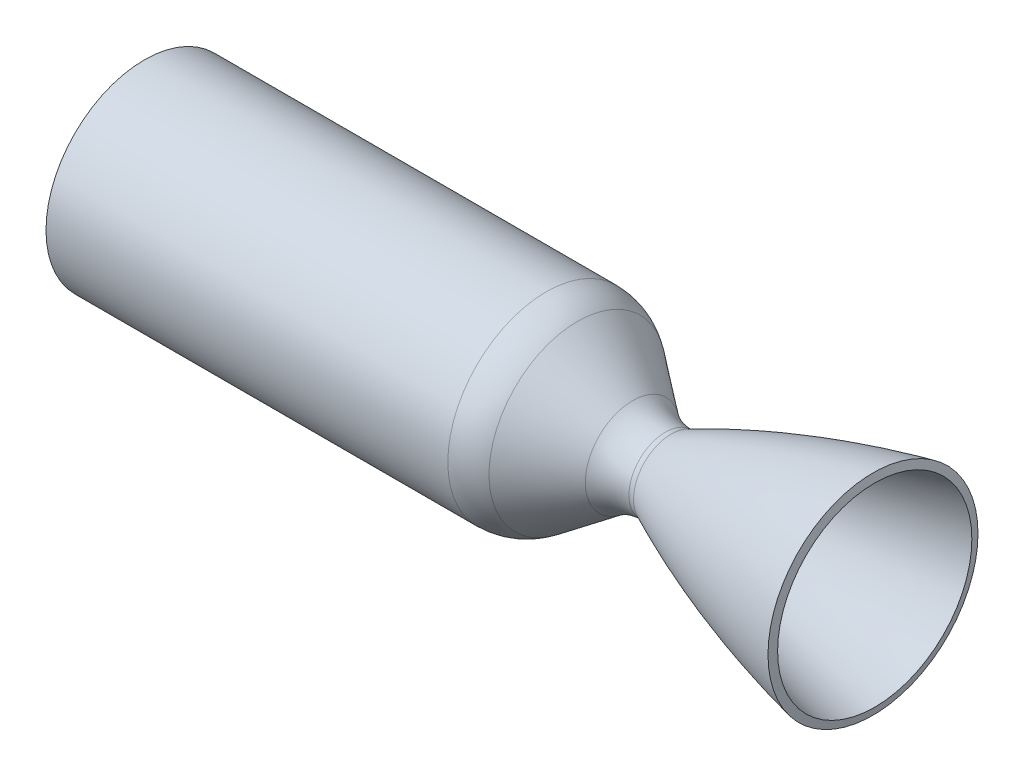
ISO-10303-21;
HEADER;
FILE_DESCRIPTION(('STEP AP214'),'2;1');
FILE_NAME('part.step','',(''),(''),'','','');
FILE_SCHEMA(('AUTOMOTIVE_DESIGN { 1 0 10303 214 1 1 1 1 }'));
ENDSEC;
DATA;
#1=APPLICATION_CONTEXT('core data for automotive mechanical design processes');
#2=APPLICATION_PROTOCOL_DEFINITION('international standard','automotive_design',2000,#1);
#3=PRODUCT_CONTEXT('',#1,'mechanical');
#4=PRODUCT('Part','Part','',(#3));
#5=PRODUCT_RELATED_PRODUCT_CATEGORY('part','',(#4));
#6=PRODUCT_DEFINITION_FORMATION('','',#4);
#7=PRODUCT_DEFINITION_CONTEXT('part definition',#1,'design');
#8=PRODUCT_DEFINITION('design','',#6,#7);
#9=PRODUCT_DEFINITION_SHAPE('','',#8);
#10=(LENGTH_UNIT() NAMED_UNIT(*) SI_UNIT(.MILLI.,.METRE.));
#11=(NAMED_UNIT(*) PLANE_ANGLE_UNIT() SI_UNIT($,.RADIAN.));
#12=(NAMED_UNIT(*) SI_UNIT($,.STERADIAN.) SOLID_ANGLE_UNIT());
#13=UNCERTAINTY_MEASURE_WITH_UNIT(LENGTH_MEASURE(1.E-05),#10,'distance_accuracy_value','');
#14=(GEOMETRIC_REPRESENTATION_CONTEXT(3) GLOBAL_UNCERTAINTY_ASSIGNED_CONTEXT((#13)) GLOBAL_UNIT_ASSIGNED_CONTEXT((#10,
#11,#12)) REPRESENTATION_CONTEXT('',''));
#15=CARTESIAN_POINT('',(0.,0.,0.));
#16=DIRECTION('',(0.,0.,1.));
#17=DIRECTION('',(1.,0.,0.));
#18=AXIS2_PLACEMENT_3D('',#15,#16,#17);
#19=CARTESIAN_POINT('',(2.92404235088785,9.57126458238494,0.));
#20=CARTESIAN_POINT('',(3.08940699363786,9.64837736477318,0.));
#21=CARTESIAN_POINT('',(3.25168178617526,9.72384845829699,0.));
#22=CARTESIAN_POINT('',(3.57932472185338,9.87583311830871,0.));
#23=CARTESIAN_POINT('',(4.07079284323801,10.103211868221,0.));
#24=CARTESIAN_POINT('',(5.21757793316896,10.6295929549315,0.));
#25=CARTESIAN_POINT('',(7.51125356226121,11.6658229324443,0.));
#26=CARTESIAN_POINT('',(9.47744494913379,12.5261705832719,0.));
#27=CARTESIAN_POINT('',(13.4100793270214,14.2109790584611,0.));
#28=CARTESIAN_POINT('',(16.0321714050114,15.2863562714288,0.));
#29=CARTESIAN_POINT('',(23.8994943783755,18.3781674129488,0.));
#30=CARTESIAN_POINT('',(29.1457760465898,20.2605421553031,0.));
#31=CARTESIAN_POINT('',(44.8889562239301,25.4336824420943,0.));
#32=CARTESIAN_POINT('',(55.3902202396386,28.25311926741,0.));
#33=CARTESIAN_POINT('',(65.8970650072209,30.5678402059277,0.));
#34=B_SPLINE_CURVE_WITH_KNOTS('',3,(#19,#20,#21,#22,#23,#24,#25,#26,#27,#28,#29,#30,#31,#32,
#33),.UNSPECIFIED.,.F.,.F.,(4,2,1,1,1,2,2,2,4),(0.,0.00781250000000004,0.0156250000000001,
0.0312500000000001,0.0625000000000002,0.125,0.25,0.5,1.),.UNSPECIFIED.);
#35=CARTESIAN_POINT('',(0.,0.,0.));
#36=DIRECTION('',(1.,0.,0.));
#37=AXIS1_PLACEMENT('',#35,#36);
#38=SURFACE_OF_REVOLUTION('',#34,#37);
#39=CARTESIAN_POINT('',(65.8970650072209,0.,0.));
#40=DIRECTION('',(1.,0.,0.));
#41=DIRECTION('',(0.,0.,-1.));
#42=AXIS2_PLACEMENT_3D('',#39,#40,#41);
#43=CIRCLE('',#42,30.5678402059277);
#44=CARTESIAN_POINT('',(65.8970650072209,0.,-30.5678402059277));
#45=VERTEX_POINT('',#44);
#46=EDGE_CURVE('E10',#45,#45,#43,.T.);
#47=ORIENTED_EDGE('',*,*,#46,.T.);
#48=EDGE_LOOP('',(#47));
#49=FACE_BOUND('',#48,.T.);
#50=CARTESIAN_POINT('',(2.92404235083581,0.,0.));
#51=DIRECTION('',(1.,0.,0.));
#52=DIRECTION('',(0.,0.,-1.));
#53=AXIS2_PLACEMENT_3D('',#50,#51,#52);
#54=CIRCLE('',#53,9.57126458249664);
#55=CARTESIAN_POINT('',(2.92404235083581,0.,-9.57126458249664));
#56=VERTEX_POINT('',#55);
#57=EDGE_CURVE('E75',#56,#56,#54,.T.);
#58=ORIENTED_EDGE('',*,*,#57,.F.);
#59=EDGE_LOOP('',(#58));
#60=FACE_BOUND('',#59,.T.);
#61=ADVANCED_FACE('F28',(#49,#60),#38,.F.);
#62=CARTESIAN_POINT('',(65.3505921066387,0.,0.));
#63=DIRECTION('',(-1.,0.,0.));
#64=DIRECTION('',(0.,0.,1.));
#65=AXIS2_PLACEMENT_3D('',#62,#63,#64);
#66=CONICAL_SURFACE('',#65,33.0483577666253,1.35395416767708);
#67=ORIENTED_EDGE('',*,*,#46,.F.);
#68=EDGE_LOOP('',(#67));
#69=FACE_BOUND('',#68,.T.);
#70=CARTESIAN_POINT('',(65.3505921066387,0.,0.));
#71=DIRECTION('',(1.,0.,0.));
#72=DIRECTION('',(0.,0.,-1.));
#73=AXIS2_PLACEMENT_3D('',#70,#71,#72);
#74=CIRCLE('',#73,33.0483577666253);
#75=CARTESIAN_POINT('',(65.3505921066387,0.,-33.0483577666253));
#76=VERTEX_POINT('',#75);
#77=EDGE_CURVE('E35',#76,#76,#74,.T.);
#78=ORIENTED_EDGE('',*,*,#77,.T.);
#79=EDGE_LOOP('',(#78));
#80=FACE_BOUND('',#79,.T.);
#81=ADVANCED_FACE('F92',(#69,#80),#66,.T.);
#82=CARTESIAN_POINT('',(1.85059196604892,11.8732863615858,0.));
#83=CARTESIAN_POINT('',(8.90614753722735,15.1634305685967,0.));
#84=CARTESIAN_POINT('',(15.9617031084052,18.1767353240991,0.));
#85=CARTESIAN_POINT('',(23.0172586795827,20.9355466774985,0.));
#86=CARTESIAN_POINT('',(30.0728142507596,23.4587985505416,0.));
#87=CARTESIAN_POINT('',(37.1283698219362,25.7628118677506,0.));
#88=CARTESIAN_POINT('',(44.1839253931123,27.8618462849323,0.));
#89=CARTESIAN_POINT('',(51.2394809642881,29.7684949518219,0.));
#90=CARTESIAN_POINT('',(58.2950365354636,31.4939765442184,0.));
#91=CARTESIAN_POINT('',(65.3505921066387,33.0483577666253,0.));
#92=B_SPLINE_CURVE_WITH_KNOTS('',9,(#82,#83,#84,#85,#86,#87,#88,#89,#90,#91),.UNSPECIFIED.,.F.,
.F.,(10,10),(0.0795696010168891,0.91632451103312),.UNSPECIFIED.);
#93=CARTESIAN_POINT('',(0.,0.,0.));
#94=DIRECTION('',(1.,0.,0.));
#95=AXIS1_PLACEMENT('',#93,#94);
#96=SURFACE_OF_REVOLUTION('',#92,#95);
#97=ORIENTED_EDGE('',*,*,#77,.F.);
#98=EDGE_LOOP('',(#97));
#99=FACE_BOUND('',#98,.T.);
#100=CARTESIAN_POINT('',(1.85059196605281,0.,0.));
#101=DIRECTION('',(1.,0.,0.));
#102=DIRECTION('',(0.,0.,-1.));
#103=AXIS2_PLACEMENT_3D('',#100,#101,#102);
#104=CIRCLE('',#103,11.8732863615876);
#105=CARTESIAN_POINT('',(1.85059196605281,0.,-11.8732863615876));
#106=VERTEX_POINT('',#105);
#107=EDGE_CURVE('E39',#106,#106,#104,.T.);
#108=ORIENTED_EDGE('',*,*,#107,.T.);
#109=EDGE_LOOP('',(#108));
#110=FACE_BOUND('',#109,.T.);
#111=ADVANCED_FACE('F88',(#99,#110),#96,.T.);
#112=CARTESIAN_POINT('',(0.,0.,0.));
#113=DIRECTION('',(1.,0.,0.));
#114=DIRECTION('',(0.,0.,-1.));
#115=AXIS2_PLACEMENT_3D('',#112,#113,#114);
#116=TOROIDAL_SURFACE('',#115,15.84189364,4.37887364);
#117=ORIENTED_EDGE('',*,*,#107,.F.);
#118=EDGE_LOOP('',(#117));
#119=FACE_BOUND('',#118,.T.);
#120=CARTESIAN_POINT('',(0.,0.,0.));
#121=DIRECTION('',(1.,0.,0.));
#122=DIRECTION('',(0.,0.,-1.));
#123=AXIS2_PLACEMENT_3D('',#120,#121,#122);
#124=CIRCLE('',#123,11.46302);
#125=CARTESIAN_POINT('',(0.,0.,-11.46302));
#126=VERTEX_POINT('',#125);
#127=EDGE_CURVE('E43',#126,#126,#124,.T.);
#128=ORIENTED_EDGE('',*,*,#127,.T.);
#129=EDGE_LOOP('',(#128));
#130=FACE_BOUND('',#129,.T.);
#131=ADVANCED_FACE('F91',(#119,#130),#116,.F.);
#132=CARTESIAN_POINT('',(0.,0.,0.));
#133=DIRECTION('',(1.,0.,0.));
#134=DIRECTION('',(0.,0.,-1.));
#135=AXIS2_PLACEMENT_3D('',#132,#133,#134);
#136=TOROIDAL_SURFACE('',#135,28.65755,17.19453);
#137=ORIENTED_EDGE('',*,*,#127,.F.);
#138=EDGE_LOOP('',(#137));
#139=FACE_BOUND('',#138,.T.);
#140=CARTESIAN_POINT('',(-10.3082918102412,0.,0.));
#141=DIRECTION('',(1.,0.,0.));
#142=DIRECTION('',(0.,0.,-1.));
#143=AXIS2_PLACEMENT_3D('',#140,#141,#142);
#144=CIRCLE('',#143,14.8956103883096);
#145=CARTESIAN_POINT('',(-10.3082918102412,0.,-14.8956103883096));
#146=VERTEX_POINT('',#145);
#147=EDGE_CURVE('E48',#146,#146,#144,.T.);
#148=ORIENTED_EDGE('',*,*,#147,.T.);
#149=EDGE_LOOP('',(#148));
#150=FACE_BOUND('',#149,.T.);
#151=ADVANCED_FACE('F153',(#139,#150),#136,.F.);
#152=CARTESIAN_POINT('',(-27.6272239050132,0.,0.));
#153=DIRECTION('',(-1.,0.,0.));
#154=DIRECTION('',(0.,0.,1.));
#155=AXIS2_PLACEMENT_3D('',#152,#153,#154);
#156=CONICAL_SURFACE('',#155,27.8682444000884,0.642888686151923);
#157=ORIENTED_EDGE('',*,*,#147,.F.);
#158=EDGE_LOOP('',(#157));
#159=FACE_BOUND('',#158,.T.);
#160=CARTESIAN_POINT('',(-27.6272239050132,0.,0.));
#161=DIRECTION('',(1.,0.,0.));
#162=DIRECTION('',(0.,0.,-1.));
#163=AXIS2_PLACEMENT_3D('',#160,#161,#162);
#164=CIRCLE('',#163,27.8682444000884);
#165=CARTESIAN_POINT('',(-27.6272239050132,0.,-27.8682444000884));
#166=VERTEX_POINT('',#165);
#167=EDGE_CURVE('E51',#166,#166,#164,.T.);
#168=ORIENTED_EDGE('',*,*,#167,.T.);
#169=EDGE_LOOP('',(#168));
#170=FACE_BOUND('',#169,.T.);
#171=ADVANCED_FACE('F150',(#159,#170),#156,.T.);
#172=CARTESIAN_POINT('',(-37.4896011471444,0.,0.));
#173=DIRECTION('',(1.,0.,0.));
#174=DIRECTION('',(0.,0.,-1.));
#175=AXIS2_PLACEMENT_3D('',#172,#173,#174);
#176=DEGENERATE_TOROIDAL_SURFACE('',#175,13.78331,17.19453,.T.);
#177=ORIENTED_EDGE('',*,*,#167,.F.);
#178=EDGE_LOOP('',(#177));
#179=FACE_BOUND('',#178,.T.);
#180=CARTESIAN_POINT('',(-37.4896011471444,0.,0.));
#181=DIRECTION('',(1.,0.,0.));
#182=DIRECTION('',(0.,0.,-1.));
#183=AXIS2_PLACEMENT_3D('',#180,#181,#182);
#184=CIRCLE('',#183,30.97784);
#185=CARTESIAN_POINT('',(-37.4896011471444,0.,-30.97784));
#186=VERTEX_POINT('',#185);
#187=EDGE_CURVE('E54',#186,#186,#184,.T.);
#188=ORIENTED_EDGE('',*,*,#187,.T.);
#189=EDGE_LOOP('',(#188));
#190=FACE_BOUND('',#189,.T.);
#191=ADVANCED_FACE('F143',(#179,#190),#176,.T.);
#192=CARTESIAN_POINT('',(0.,0.,0.));
#193=DIRECTION('',(1.,0.,0.));
#194=DIRECTION('',(0.,0.,-1.));
#195=AXIS2_PLACEMENT_3D('',#192,#193,#194);
#196=CYLINDRICAL_SURFACE('',#195,30.97784);
#197=ORIENTED_EDGE('',*,*,#187,.F.);
#198=EDGE_LOOP('',(#197));
#199=FACE_BOUND('',#198,.T.);
#200=CARTESIAN_POINT('',(-163.951121147144,0.,0.));
#201=DIRECTION('',(1.,0.,0.));
#202=DIRECTION('',(0.,0.,-1.));
#203=AXIS2_PLACEMENT_3D('',#200,#201,#202);
#204=CIRCLE('',#203,30.97784);
#205=CARTESIAN_POINT('',(-163.951121147144,0.,-30.97784));
#206=VERTEX_POINT('',#205);
#207=EDGE_CURVE('E57',#206,#206,#204,.T.);
#208=ORIENTED_EDGE('',*,*,#207,.T.);
#209=EDGE_LOOP('',(#208));
#210=FACE_BOUND('',#209,.T.);
#211=ADVANCED_FACE('F137',(#199,#210),#196,.T.);
#212=CARTESIAN_POINT('',(-163.951121147144,28.43784,0.));
#213=DIRECTION('',(1.,0.,0.));
#214=DIRECTION('',(0.,0.,-1.));
#215=AXIS2_PLACEMENT_3D('',#212,#213,#214);
#216=PLANE('',#215);
#217=ORIENTED_EDGE('',*,*,#207,.F.);
#218=EDGE_LOOP('',(#217));
#219=FACE_BOUND('',#218,.T.);
#220=CARTESIAN_POINT('',(-163.951121147144,0.,0.));
#221=DIRECTION('',(1.,0.,0.));
#222=DIRECTION('',(0.,0.,-1.));
#223=AXIS2_PLACEMENT_3D('',#220,#221,#222);
#224=CIRCLE('',#223,28.43784);
#225=CARTESIAN_POINT('',(-163.951121147144,0.,-28.43784));
#226=VERTEX_POINT('',#225);
#227=EDGE_CURVE('E60',#226,#226,#224,.T.);
#228=ORIENTED_EDGE('',*,*,#227,.T.);
#229=EDGE_LOOP('',(#228));
#230=FACE_BOUND('',#229,.T.);
#231=ADVANCED_FACE('F132',(#219,#230),#216,.F.);
#232=CARTESIAN_POINT('',(0.,0.,0.));
#233=DIRECTION('',(1.,0.,0.));
#234=DIRECTION('',(0.,0.,-1.));
#235=AXIS2_PLACEMENT_3D('',#232,#233,#234);
#236=CYLINDRICAL_SURFACE('',#235,28.43784);
#237=CARTESIAN_POINT('',(-37.4896011471444,0.,0.));
#238=DIRECTION('',(1.,0.,0.));
#239=DIRECTION('',(0.,0.,-1.));
#240=AXIS2_PLACEMENT_3D('',#237,#238,#239);
#241=CIRCLE('',#240,28.43784);
#242=CARTESIAN_POINT('',(-37.4896011471444,0.,-28.43784));
#243=VERTEX_POINT('',#242);
#244=EDGE_CURVE('E63',#243,#243,#241,.T.);
#245=ORIENTED_EDGE('',*,*,#244,.T.);
#246=EDGE_LOOP('',(#245));
#247=FACE_BOUND('',#246,.T.);
#248=ORIENTED_EDGE('',*,*,#227,.F.);
#249=EDGE_LOOP('',(#248));
#250=FACE_BOUND('',#249,.T.);
#251=ADVANCED_FACE('F126',(#247,#250),#236,.F.);
#252=CARTESIAN_POINT('',(-37.4896011471444,0.,0.));
#253=DIRECTION('',(1.,0.,0.));
#254=DIRECTION('',(0.,0.,-1.));
#255=AXIS2_PLACEMENT_3D('',#252,#253,#254);
#256=DEGENERATE_TOROIDAL_SURFACE('',#255,13.78331,14.65453,.T.);
#257=CARTESIAN_POINT('',(-29.1161251097341,0.,0.));
#258=DIRECTION('',(1.,0.,0.));
#259=DIRECTION('',(0.,0.,-1.));
#260=AXIS2_PLACEMENT_3D('',#257,#258,#259);
#261=CIRCLE('',#260,25.8099532794781);
#262=CARTESIAN_POINT('',(-29.1161251097341,0.,-25.8099532794781));
#263=VERTEX_POINT('',#262);
#264=EDGE_CURVE('E66',#263,#263,#261,.T.);
#265=ORIENTED_EDGE('',*,*,#264,.T.);
#266=EDGE_LOOP('',(#265));
#267=FACE_BOUND('',#266,.T.);
#268=ORIENTED_EDGE('',*,*,#244,.F.);
#269=EDGE_LOOP('',(#268));
#270=FACE_BOUND('',#269,.T.);
#271=ADVANCED_FACE('F120',(#267,#270),#256,.F.);
#272=CARTESIAN_POINT('',(-29.1161251097341,0.,0.));
#273=DIRECTION('',(-1.,0.,0.));
#274=DIRECTION('',(0.,0.,1.));
#275=AXIS2_PLACEMENT_3D('',#272,#273,#274);
#276=CONICAL_SURFACE('',#275,25.8099532794781,0.642888686151923);
#277=CARTESIAN_POINT('',(-11.8310470817149,0.,0.));
#278=DIRECTION('',(1.,0.,0.));
#279=DIRECTION('',(0.,0.,-1.));
#280=AXIS2_PLACEMENT_3D('',#277,#278,#279);
#281=CIRCLE('',#280,12.8626774373249);
#282=CARTESIAN_POINT('',(-11.8310470817149,0.,-12.8626774373249));
#283=VERTEX_POINT('',#282);
#284=EDGE_CURVE('E69',#283,#283,#281,.T.);
#285=ORIENTED_EDGE('',*,*,#284,.T.);
#286=EDGE_LOOP('',(#285));
#287=FACE_BOUND('',#286,.T.);
#288=ORIENTED_EDGE('',*,*,#264,.F.);
#289=EDGE_LOOP('',(#288));
#290=FACE_BOUND('',#289,.T.);
#291=ADVANCED_FACE('F114',(#287,#290),#276,.F.);
#292=CARTESIAN_POINT('',(0.,0.,0.));
#293=DIRECTION('',(1.,0.,0.));
#294=DIRECTION('',(0.,0.,-1.));
#295=AXIS2_PLACEMENT_3D('',#292,#293,#294);
#296=TOROIDAL_SURFACE('',#295,28.65755,19.73453);
#297=CARTESIAN_POINT('',(0.,0.,0.));
#298=DIRECTION('',(1.,0.,0.));
#299=DIRECTION('',(0.,0.,-1.));
#300=AXIS2_PLACEMENT_3D('',#297,#298,#299);
#301=CIRCLE('',#300,8.92302);
#302=CARTESIAN_POINT('',(0.,0.,-8.92302));
#303=VERTEX_POINT('',#302);
#304=EDGE_CURVE('E72',#303,#303,#301,.T.);
#305=ORIENTED_EDGE('',*,*,#304,.T.);
#306=EDGE_LOOP('',(#305));
#307=FACE_BOUND('',#306,.T.);
#308=ORIENTED_EDGE('',*,*,#284,.F.);
#309=EDGE_LOOP('',(#308));
#310=FACE_BOUND('',#309,.T.);
#311=ADVANCED_FACE('F108',(#307,#310),#296,.T.);
#312=CARTESIAN_POINT('',(0.,0.,0.));
#313=DIRECTION('',(1.,0.,0.));
#314=DIRECTION('',(0.,0.,-1.));
#315=AXIS2_PLACEMENT_3D('',#312,#313,#314);
#316=TOROIDAL_SURFACE('',#315,15.84189364,6.91887364);
#317=ORIENTED_EDGE('',*,*,#57,.T.);
#318=EDGE_LOOP('',(#317));
#319=FACE_BOUND('',#318,.T.);
#320=ORIENTED_EDGE('',*,*,#304,.F.);
#321=EDGE_LOOP('',(#320));
#322=FACE_BOUND('',#321,.T.);
#323=ADVANCED_FACE('F105',(#319,#322),#316,.T.);
#324=CLOSED_SHELL('',(#61,#81,#111,#131,#151,#171,#191,#211,#231,#251,#271,#291,#311,#323));
#325=MANIFOLD_SOLID_BREP('B2',#324);
#326=ADVANCED_BREP_SHAPE_REPRESENTATION('',(#18,#325),#14);
#327=SHAPE_DEFINITION_REPRESENTATION(#9,#326);
ENDSEC;
END-ISO-10303-21;
